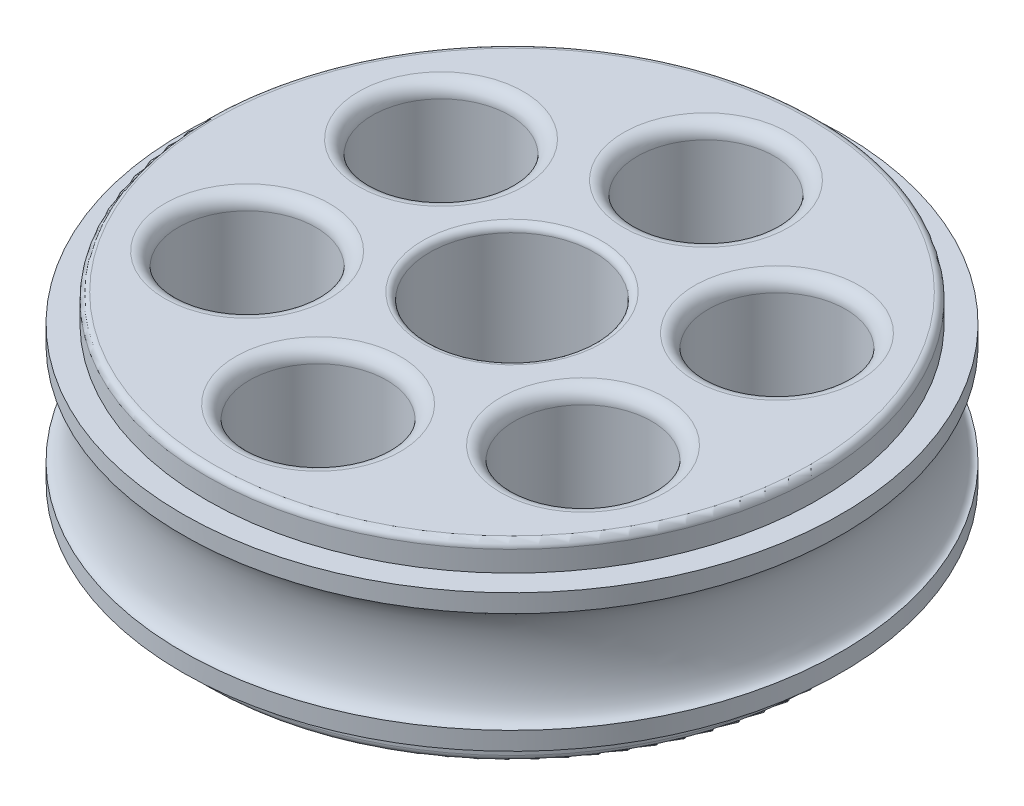
ISO-10303-21;
HEADER;
FILE_DESCRIPTION(('STEP AP214'),'2;1');
FILE_NAME('part.step','',(''),(''),'','','');
FILE_SCHEMA(('AUTOMOTIVE_DESIGN { 1 0 10303 214 1 1 1 1 }'));
ENDSEC;
DATA;
#1=APPLICATION_CONTEXT('core data for automotive mechanical design processes');
#2=APPLICATION_PROTOCOL_DEFINITION('international standard','automotive_design',2000,#1);
#3=PRODUCT_CONTEXT('',#1,'mechanical');
#4=PRODUCT('Part','Part','',(#3));
#5=PRODUCT_RELATED_PRODUCT_CATEGORY('part','',(#4));
#6=PRODUCT_DEFINITION_FORMATION('','',#4);
#7=PRODUCT_DEFINITION_CONTEXT('part definition',#1,'design');
#8=PRODUCT_DEFINITION('design','',#6,#7);
#9=PRODUCT_DEFINITION_SHAPE('','',#8);
#10=(LENGTH_UNIT() NAMED_UNIT(*) SI_UNIT(.MILLI.,.METRE.));
#11=(NAMED_UNIT(*) PLANE_ANGLE_UNIT() SI_UNIT($,.RADIAN.));
#12=(NAMED_UNIT(*) SI_UNIT($,.STERADIAN.) SOLID_ANGLE_UNIT());
#13=UNCERTAINTY_MEASURE_WITH_UNIT(LENGTH_MEASURE(1.E-05),#10,'distance_accuracy_value','');
#14=(GEOMETRIC_REPRESENTATION_CONTEXT(3) GLOBAL_UNCERTAINTY_ASSIGNED_CONTEXT((#13)) GLOBAL_UNIT_ASSIGNED_CONTEXT((#10,
#11,#12)) REPRESENTATION_CONTEXT('',''));
#15=CARTESIAN_POINT('',(0.,0.,0.));
#16=DIRECTION('',(0.,0.,1.));
#17=DIRECTION('',(1.,0.,0.));
#18=AXIS2_PLACEMENT_3D('',#15,#16,#17);
#19=CARTESIAN_POINT('',(0.,15.24,0.));
#20=DIRECTION('',(0.,-1.,0.));
#21=DIRECTION('',(0.,0.,-1.));
#22=AXIS2_PLACEMENT_3D('',#19,#20,#21);
#23=CYLINDRICAL_SURFACE('',#22,30.48);
#24=CARTESIAN_POINT('',(0.,15.24,0.));
#25=DIRECTION('',(0.,1.,0.));
#26=DIRECTION('',(0.,0.,1.));
#27=AXIS2_PLACEMENT_3D('',#24,#25,#26);
#28=CIRCLE('',#27,30.48);
#29=CARTESIAN_POINT('',(0.,15.24,30.48));
#30=VERTEX_POINT('',#29);
#31=EDGE_CURVE('E56',#30,#30,#28,.T.);
#32=ORIENTED_EDGE('',*,*,#31,.F.);
#33=EDGE_LOOP('',(#32));
#34=FACE_BOUND('',#33,.T.);
#35=CARTESIAN_POINT('',(0.,13.5621595032944,0.));
#36=DIRECTION('',(0.,-1.,0.));
#37=DIRECTION('',(0.,0.,-1.));
#38=AXIS2_PLACEMENT_3D('',#35,#36,#37);
#39=CIRCLE('',#38,30.48);
#40=CARTESIAN_POINT('',(0.,13.5621595032944,-30.48));
#41=VERTEX_POINT('',#40);
#42=EDGE_CURVE('E35',#41,#41,#39,.T.);
#43=ORIENTED_EDGE('',*,*,#42,.F.);
#44=EDGE_LOOP('',(#43));
#45=FACE_BOUND('',#44,.T.);
#46=ADVANCED_FACE('F31',(#34,#45),#23,.T.);
#47=CARTESIAN_POINT('',(0.,2.54,0.));
#48=DIRECTION('',(0.,1.,0.));
#49=DIRECTION('',(0.,0.,1.));
#50=AXIS2_PLACEMENT_3D('',#47,#48,#49);
#51=CIRCLE('',#50,30.48);
#52=CARTESIAN_POINT('',(0.,2.54,30.48));
#53=VERTEX_POINT('',#52);
#54=EDGE_CURVE('E52',#53,#53,#51,.T.);
#55=ORIENTED_EDGE('',*,*,#54,.T.);
#56=EDGE_LOOP('',(#55));
#57=FACE_BOUND('',#56,.T.);
#58=CARTESIAN_POINT('',(0.,4.21784049670554,0.));
#59=DIRECTION('',(0.,-1.,0.));
#60=DIRECTION('',(0.,0.,-1.));
#61=AXIS2_PLACEMENT_3D('',#58,#59,#60);
#62=CIRCLE('',#61,30.48);
#63=CARTESIAN_POINT('',(0.,4.21784049670551,-30.48));
#64=VERTEX_POINT('',#63);
#65=EDGE_CURVE('E47',#64,#64,#62,.F.);
#66=ORIENTED_EDGE('',*,*,#65,.F.);
#67=EDGE_LOOP('',(#66));
#68=FACE_BOUND('',#67,.T.);
#69=ADVANCED_FACE('F178',(#57,#68),#23,.T.);
#70=CARTESIAN_POINT('',(0.,2.54,0.));
#71=DIRECTION('',(0.,-1.,0.));
#72=DIRECTION('',(0.,0.,-1.));
#73=AXIS2_PLACEMENT_3D('',#70,#71,#72);
#74=CYLINDRICAL_SURFACE('',#73,28.2575);
#75=CARTESIAN_POINT('',(0.,0.635,0.));
#76=DIRECTION('',(0.,1.,0.));
#77=DIRECTION('',(0.,0.,1.));
#78=AXIS2_PLACEMENT_3D('',#75,#76,#77);
#79=CIRCLE('',#78,28.2575);
#80=CARTESIAN_POINT('',(0.,0.635,28.2575));
#81=VERTEX_POINT('',#80);
#82=EDGE_CURVE('E89',#81,#81,#79,.T.);
#83=ORIENTED_EDGE('',*,*,#82,.T.);
#84=EDGE_LOOP('',(#83));
#85=FACE_BOUND('',#84,.T.);
#86=CARTESIAN_POINT('',(0.,2.54,0.));
#87=DIRECTION('',(0.,1.,0.));
#88=DIRECTION('',(0.,0.,1.));
#89=AXIS2_PLACEMENT_3D('',#86,#87,#88);
#90=CIRCLE('',#89,28.2575);
#91=CARTESIAN_POINT('',(0.,2.54,28.2575));
#92=VERTEX_POINT('',#91);
#93=EDGE_CURVE('E61',#92,#92,#90,.T.);
#94=ORIENTED_EDGE('',*,*,#93,.F.);
#95=EDGE_LOOP('',(#94));
#96=FACE_BOUND('',#95,.T.);
#97=ADVANCED_FACE('F184',(#85,#96),#74,.T.);
#98=CARTESIAN_POINT('',(0.,0.,0.));
#99=DIRECTION('',(0.,1.,0.));
#100=DIRECTION('',(0.,0.,1.));
#101=AXIS2_PLACEMENT_3D('',#98,#99,#100);
#102=PLANE('',#101);
#103=CARTESIAN_POINT('',(0.,0.,17.93875));
#104=DIRECTION('',(0.,1.,0.));
#105=DIRECTION('',(0.,0.,1.));
#106=AXIS2_PLACEMENT_3D('',#103,#104,#105);
#107=CIRCLE('',#106,7.62);
#108=CARTESIAN_POINT('',(0.,0.,25.55875));
#109=VERTEX_POINT('',#108);
#110=EDGE_CURVE('E113',#109,#109,#107,.T.);
#111=ORIENTED_EDGE('',*,*,#110,.T.);
#112=EDGE_LOOP('',(#111));
#113=FACE_BOUND('',#112,.T.);
#114=CARTESIAN_POINT('',(-15.5354132121376,0.,8.96937499999911));
#115=DIRECTION('',(0.,1.,0.));
#116=DIRECTION('',(0.,0.,1.));
#117=AXIS2_PLACEMENT_3D('',#114,#115,#116);
#118=CIRCLE('',#117,7.62000000000096);
#119=CARTESIAN_POINT('',(-15.5354132121376,0.,16.5893750000001));
#120=VERTEX_POINT('',#119);
#121=EDGE_CURVE('E110',#120,#120,#118,.T.);
#122=ORIENTED_EDGE('',*,*,#121,.T.);
#123=EDGE_LOOP('',(#122));
#124=FACE_BOUND('',#123,.T.);
#125=CARTESIAN_POINT('',(-15.5354132121366,0.,-8.96937500000089));
#126=DIRECTION('',(0.,1.,0.));
#127=DIRECTION('',(0.,0.,1.));
#128=AXIS2_PLACEMENT_3D('',#125,#126,#127);
#129=CIRCLE('',#128,7.62000000000188);
#130=CARTESIAN_POINT('',(-15.5354132121366,0.,-1.34937499999901));
#131=VERTEX_POINT('',#130);
#132=EDGE_CURVE('E107',#131,#131,#129,.T.);
#133=ORIENTED_EDGE('',*,*,#132,.T.);
#134=EDGE_LOOP('',(#133));
#135=FACE_BOUND('',#134,.T.);
#136=CARTESIAN_POINT('',(2.035006033625E-12,0.,-17.93875));
#137=DIRECTION('',(0.,1.,0.));
#138=DIRECTION('',(0.,0.,1.));
#139=AXIS2_PLACEMENT_3D('',#136,#137,#138);
#140=CIRCLE('',#139,7.62000000000207);
#141=CARTESIAN_POINT('',(2.035006033625E-12,0.,-10.3187499999979));
#142=VERTEX_POINT('',#141);
#143=EDGE_CURVE('E104',#142,#142,#140,.T.);
#144=ORIENTED_EDGE('',*,*,#143,.T.);
#145=EDGE_LOOP('',(#144));
#146=FACE_BOUND('',#145,.T.);
#147=CARTESIAN_POINT('',(15.5354132121396,0.,-8.96937499999911));
#148=DIRECTION('',(0.,1.,0.));
#149=DIRECTION('',(0.,0.,1.));
#150=AXIS2_PLACEMENT_3D('',#147,#148,#149);
#151=CIRCLE('',#150,7.62000000000128);
#152=CARTESIAN_POINT('',(15.5354132121396,0.,-1.34937499999783));
#153=VERTEX_POINT('',#152);
#154=EDGE_CURVE('E101',#153,#153,#151,.T.);
#155=ORIENTED_EDGE('',*,*,#154,.T.);
#156=EDGE_LOOP('',(#155));
#157=FACE_BOUND('',#156,.T.);
#158=CARTESIAN_POINT('',(15.5354132121386,0.,8.96937500000088));
#159=DIRECTION('',(0.,1.,0.));
#160=DIRECTION('',(0.,0.,1.));
#161=AXIS2_PLACEMENT_3D('',#158,#159,#160);
#162=CIRCLE('',#161,7.62000000000027);
#163=CARTESIAN_POINT('',(15.5354132121386,0.,16.5893750000012));
#164=VERTEX_POINT('',#163);
#165=EDGE_CURVE('E98',#164,#164,#162,.T.);
#166=ORIENTED_EDGE('',*,*,#165,.T.);
#167=EDGE_LOOP('',(#166));
#168=FACE_BOUND('',#167,.T.);
#169=CARTESIAN_POINT('',(0.,0.,0.));
#170=DIRECTION('',(0.,1.,0.));
#171=DIRECTION('',(0.,0.,1.));
#172=AXIS2_PLACEMENT_3D('',#169,#170,#171);
#173=CIRCLE('',#172,8.255);
#174=CARTESIAN_POINT('',(0.,0.,8.255));
#175=VERTEX_POINT('',#174);
#176=EDGE_CURVE('E71',#175,#175,#173,.T.);
#177=ORIENTED_EDGE('',*,*,#176,.T.);
#178=EDGE_LOOP('',(#177));
#179=FACE_BOUND('',#178,.T.);
#180=CARTESIAN_POINT('',(0.,0.,0.));
#181=DIRECTION('',(0.,1.,0.));
#182=DIRECTION('',(0.,0.,1.));
#183=AXIS2_PLACEMENT_3D('',#180,#181,#182);
#184=CIRCLE('',#183,27.6225);
#185=CARTESIAN_POINT('',(0.,0.,27.6225));
#186=VERTEX_POINT('',#185);
#187=EDGE_CURVE('E68',#186,#186,#184,.F.);
#188=ORIENTED_EDGE('',*,*,#187,.T.);
#189=EDGE_LOOP('',(#188));
#190=FACE_BOUND('',#189,.T.);
#191=ADVANCED_FACE('F191',(#113,#124,#135,#146,#157,#168,#179,#190),#102,.F.);
#192=CARTESIAN_POINT('',(0.,15.24,0.));
#193=DIRECTION('',(0.,1.,0.));
#194=DIRECTION('',(0.,0.,1.));
#195=AXIS2_PLACEMENT_3D('',#192,#193,#194);
#196=PLANE('',#195);
#197=CARTESIAN_POINT('',(0.,15.24,0.));
#198=DIRECTION('',(0.,1.,0.));
#199=DIRECTION('',(0.,0.,1.));
#200=AXIS2_PLACEMENT_3D('',#197,#198,#199);
#201=CIRCLE('',#200,28.2575);
#202=CARTESIAN_POINT('',(0.,15.24,28.2575));
#203=VERTEX_POINT('',#202);
#204=EDGE_CURVE('E67',#203,#203,#201,.T.);
#205=ORIENTED_EDGE('',*,*,#204,.F.);
#206=EDGE_LOOP('',(#205));
#207=FACE_BOUND('',#206,.T.);
#208=ORIENTED_EDGE('',*,*,#31,.T.);
#209=EDGE_LOOP('',(#208));
#210=FACE_BOUND('',#209,.T.);
#211=ADVANCED_FACE('F194',(#207,#210),#196,.T.);
#212=CARTESIAN_POINT('',(0.,2.54,0.));
#213=DIRECTION('',(0.,1.,0.));
#214=DIRECTION('',(0.,0.,1.));
#215=AXIS2_PLACEMENT_3D('',#212,#213,#214);
#216=PLANE('',#215);
#217=ORIENTED_EDGE('',*,*,#93,.T.);
#218=EDGE_LOOP('',(#217));
#219=FACE_BOUND('',#218,.T.);
#220=ORIENTED_EDGE('',*,*,#54,.F.);
#221=EDGE_LOOP('',(#220));
#222=FACE_BOUND('',#221,.T.);
#223=ADVANCED_FACE('F189',(#219,#222),#216,.F.);
#224=CARTESIAN_POINT('',(0.,17.78,0.));
#225=DIRECTION('',(0.,-1.,0.));
#226=DIRECTION('',(0.,0.,-1.));
#227=AXIS2_PLACEMENT_3D('',#224,#225,#226);
#228=CYLINDRICAL_SURFACE('',#227,28.2575);
#229=CARTESIAN_POINT('',(0.,17.145,0.));
#230=DIRECTION('',(0.,1.,0.));
#231=DIRECTION('',(0.,0.,1.));
#232=AXIS2_PLACEMENT_3D('',#229,#230,#231);
#233=CIRCLE('',#232,28.2575);
#234=CARTESIAN_POINT('',(0.,17.145,28.2575));
#235=VERTEX_POINT('',#234);
#236=EDGE_CURVE('E86',#235,#235,#233,.F.);
#237=ORIENTED_EDGE('',*,*,#236,.T.);
#238=EDGE_LOOP('',(#237));
#239=FACE_BOUND('',#238,.T.);
#240=ORIENTED_EDGE('',*,*,#204,.T.);
#241=EDGE_LOOP('',(#240));
#242=FACE_BOUND('',#241,.T.);
#243=ADVANCED_FACE('F262',(#239,#242),#228,.T.);
#244=CARTESIAN_POINT('',(0.,17.78,0.));
#245=DIRECTION('',(0.,1.,0.));
#246=DIRECTION('',(0.,0.,1.));
#247=AXIS2_PLACEMENT_3D('',#244,#245,#246);
#248=PLANE('',#247);
#249=CARTESIAN_POINT('',(0.,17.78,17.93875));
#250=DIRECTION('',(0.,1.,0.));
#251=DIRECTION('',(0.,0.,1.));
#252=AXIS2_PLACEMENT_3D('',#249,#250,#251);
#253=CIRCLE('',#252,7.62);
#254=CARTESIAN_POINT('',(0.,17.78,25.55875));
#255=VERTEX_POINT('',#254);
#256=EDGE_CURVE('E131',#255,#255,#253,.F.);
#257=ORIENTED_EDGE('',*,*,#256,.T.);
#258=EDGE_LOOP('',(#257));
#259=FACE_BOUND('',#258,.T.);
#260=CARTESIAN_POINT('',(-15.5354132121376,17.78,8.96937499999911));
#261=DIRECTION('',(0.,1.,0.));
#262=DIRECTION('',(0.,0.,1.));
#263=AXIS2_PLACEMENT_3D('',#260,#261,#262);
#264=CIRCLE('',#263,7.62000000000096);
#265=CARTESIAN_POINT('',(-15.5354132121376,17.78,16.5893750000001));
#266=VERTEX_POINT('',#265);
#267=EDGE_CURVE('E128',#266,#266,#264,.F.);
#268=ORIENTED_EDGE('',*,*,#267,.T.);
#269=EDGE_LOOP('',(#268));
#270=FACE_BOUND('',#269,.T.);
#271=CARTESIAN_POINT('',(-15.5354132121366,17.78,-8.96937500000089));
#272=DIRECTION('',(0.,1.,0.));
#273=DIRECTION('',(0.,0.,1.));
#274=AXIS2_PLACEMENT_3D('',#271,#272,#273);
#275=CIRCLE('',#274,7.62000000000188);
#276=CARTESIAN_POINT('',(-15.5354132121366,17.78,-1.34937499999901));
#277=VERTEX_POINT('',#276);
#278=EDGE_CURVE('E125',#277,#277,#275,.F.);
#279=ORIENTED_EDGE('',*,*,#278,.T.);
#280=EDGE_LOOP('',(#279));
#281=FACE_BOUND('',#280,.T.);
#282=CARTESIAN_POINT('',(2.035006033625E-12,17.78,-17.93875));
#283=DIRECTION('',(0.,1.,0.));
#284=DIRECTION('',(0.,0.,1.));
#285=AXIS2_PLACEMENT_3D('',#282,#283,#284);
#286=CIRCLE('',#285,7.62000000000207);
#287=CARTESIAN_POINT('',(2.035006033625E-12,17.78,-10.3187499999979));
#288=VERTEX_POINT('',#287);
#289=EDGE_CURVE('E122',#288,#288,#286,.F.);
#290=ORIENTED_EDGE('',*,*,#289,.T.);
#291=EDGE_LOOP('',(#290));
#292=FACE_BOUND('',#291,.T.);
#293=CARTESIAN_POINT('',(15.5354132121396,17.78,-8.96937499999911));
#294=DIRECTION('',(0.,1.,0.));
#295=DIRECTION('',(0.,0.,1.));
#296=AXIS2_PLACEMENT_3D('',#293,#294,#295);
#297=CIRCLE('',#296,7.62000000000128);
#298=CARTESIAN_POINT('',(15.5354132121396,17.78,-1.34937499999783));
#299=VERTEX_POINT('',#298);
#300=EDGE_CURVE('E119',#299,#299,#297,.F.);
#301=ORIENTED_EDGE('',*,*,#300,.T.);
#302=EDGE_LOOP('',(#301));
#303=FACE_BOUND('',#302,.T.);
#304=CARTESIAN_POINT('',(15.5354132121386,17.78,8.96937500000088));
#305=DIRECTION('',(0.,1.,0.));
#306=DIRECTION('',(0.,0.,1.));
#307=AXIS2_PLACEMENT_3D('',#304,#305,#306);
#308=CIRCLE('',#307,7.62000000000027);
#309=CARTESIAN_POINT('',(15.5354132121386,17.78,16.5893750000012));
#310=VERTEX_POINT('',#309);
#311=EDGE_CURVE('E116',#310,#310,#308,.F.);
#312=ORIENTED_EDGE('',*,*,#311,.T.);
#313=EDGE_LOOP('',(#312));
#314=FACE_BOUND('',#313,.T.);
#315=CARTESIAN_POINT('',(0.,17.78,0.));
#316=DIRECTION('',(0.,1.,0.));
#317=DIRECTION('',(0.,0.,1.));
#318=AXIS2_PLACEMENT_3D('',#315,#316,#317);
#319=CIRCLE('',#318,8.255);
#320=CARTESIAN_POINT('',(0.,17.78,8.255));
#321=VERTEX_POINT('',#320);
#322=EDGE_CURVE('E83',#321,#321,#319,.F.);
#323=ORIENTED_EDGE('',*,*,#322,.T.);
#324=EDGE_LOOP('',(#323));
#325=FACE_BOUND('',#324,.T.);
#326=CARTESIAN_POINT('',(0.,17.78,0.));
#327=DIRECTION('',(0.,1.,0.));
#328=DIRECTION('',(0.,0.,1.));
#329=AXIS2_PLACEMENT_3D('',#326,#327,#328);
#330=CIRCLE('',#329,27.6225);
#331=CARTESIAN_POINT('',(0.,17.78,27.6225));
#332=VERTEX_POINT('',#331);
#333=EDGE_CURVE('E80',#332,#332,#330,.T.);
#334=ORIENTED_EDGE('',*,*,#333,.T.);
#335=EDGE_LOOP('',(#334));
#336=FACE_BOUND('',#335,.T.);
#337=ADVANCED_FACE('F259',(#259,#270,#281,#292,#303,#314,#325,#336),#248,.T.);
#338=CARTESIAN_POINT('',(0.,0.,0.));
#339=DIRECTION('',(0.,1.,0.));
#340=DIRECTION('',(0.,0.,1.));
#341=AXIS2_PLACEMENT_3D('',#338,#339,#340);
#342=CYLINDRICAL_SURFACE('',#341,7.62);
#343=CARTESIAN_POINT('',(0.,0.635,0.));
#344=DIRECTION('',(0.,1.,0.));
#345=DIRECTION('',(0.,0.,1.));
#346=AXIS2_PLACEMENT_3D('',#343,#344,#345);
#347=CIRCLE('',#346,7.62);
#348=CARTESIAN_POINT('',(0.,0.635,7.62));
#349=VERTEX_POINT('',#348);
#350=EDGE_CURVE('E77',#349,#349,#347,.F.);
#351=ORIENTED_EDGE('',*,*,#350,.T.);
#352=EDGE_LOOP('',(#351));
#353=FACE_BOUND('',#352,.T.);
#354=CARTESIAN_POINT('',(0.,17.145,0.));
#355=DIRECTION('',(0.,1.,0.));
#356=DIRECTION('',(0.,0.,1.));
#357=AXIS2_PLACEMENT_3D('',#354,#355,#356);
#358=CIRCLE('',#357,7.62);
#359=CARTESIAN_POINT('',(0.,17.145,7.62));
#360=VERTEX_POINT('',#359);
#361=EDGE_CURVE('E74',#360,#360,#358,.T.);
#362=ORIENTED_EDGE('',*,*,#361,.T.);
#363=EDGE_LOOP('',(#362));
#364=FACE_BOUND('',#363,.T.);
#365=ADVANCED_FACE('F203',(#353,#364),#342,.F.);
#366=CARTESIAN_POINT('',(0.,0.635,0.));
#367=DIRECTION('',(0.,1.,0.));
#368=DIRECTION('',(0.,0.,1.));
#369=AXIS2_PLACEMENT_3D('',#366,#367,#368);
#370=TOROIDAL_SURFACE('',#369,8.255,0.635);
#371=ORIENTED_EDGE('',*,*,#350,.F.);
#372=EDGE_LOOP('',(#371));
#373=FACE_BOUND('',#372,.T.);
#374=ORIENTED_EDGE('',*,*,#176,.F.);
#375=EDGE_LOOP('',(#374));
#376=FACE_BOUND('',#375,.T.);
#377=ADVANCED_FACE('F199',(#373,#376),#370,.T.);
#378=CARTESIAN_POINT('',(0.,17.145,0.));
#379=DIRECTION('',(0.,1.,0.));
#380=DIRECTION('',(0.,0.,1.));
#381=AXIS2_PLACEMENT_3D('',#378,#379,#380);
#382=TOROIDAL_SURFACE('',#381,8.255,0.635);
#383=ORIENTED_EDGE('',*,*,#322,.F.);
#384=EDGE_LOOP('',(#383));
#385=FACE_BOUND('',#384,.T.);
#386=ORIENTED_EDGE('',*,*,#361,.F.);
#387=EDGE_LOOP('',(#386));
#388=FACE_BOUND('',#387,.T.);
#389=ADVANCED_FACE('F202',(#385,#388),#382,.T.);
#390=CARTESIAN_POINT('',(0.,17.145,0.));
#391=DIRECTION('',(0.,1.,0.));
#392=DIRECTION('',(0.,0.,1.));
#393=AXIS2_PLACEMENT_3D('',#390,#391,#392);
#394=TOROIDAL_SURFACE('',#393,27.6225,0.635);
#395=ORIENTED_EDGE('',*,*,#236,.F.);
#396=EDGE_LOOP('',(#395));
#397=FACE_BOUND('',#396,.T.);
#398=ORIENTED_EDGE('',*,*,#333,.F.);
#399=EDGE_LOOP('',(#398));
#400=FACE_BOUND('',#399,.T.);
#401=ADVANCED_FACE('F207',(#397,#400),#394,.T.);
#402=CARTESIAN_POINT('',(0.,0.635,0.));
#403=DIRECTION('',(0.,1.,0.));
#404=DIRECTION('',(0.,0.,1.));
#405=AXIS2_PLACEMENT_3D('',#402,#403,#404);
#406=TOROIDAL_SURFACE('',#405,27.6225,0.635);
#407=ORIENTED_EDGE('',*,*,#187,.F.);
#408=EDGE_LOOP('',(#407));
#409=FACE_BOUND('',#408,.T.);
#410=ORIENTED_EDGE('',*,*,#82,.F.);
#411=EDGE_LOOP('',(#410));
#412=FACE_BOUND('',#411,.T.);
#413=ADVANCED_FACE('F211',(#409,#412),#406,.T.);
#414=CARTESIAN_POINT('',(0.,17.78,17.93875));
#415=DIRECTION('',(0.,-1.,0.));
#416=DIRECTION('',(0.,0.,-1.));
#417=AXIS2_PLACEMENT_3D('',#414,#415,#416);
#418=CYLINDRICAL_SURFACE('',#417,6.35);
#419=CARTESIAN_POINT('',(0.,1.27,17.93875));
#420=DIRECTION('',(0.,1.,0.));
#421=DIRECTION('',(0.,0.,1.));
#422=AXIS2_PLACEMENT_3D('',#419,#420,#421);
#423=CIRCLE('',#422,6.35);
#424=CARTESIAN_POINT('',(0.,1.27,24.28875));
#425=VERTEX_POINT('',#424);
#426=EDGE_CURVE('E95',#425,#425,#423,.F.);
#427=ORIENTED_EDGE('',*,*,#426,.T.);
#428=EDGE_LOOP('',(#427));
#429=FACE_BOUND('',#428,.T.);
#430=CARTESIAN_POINT('',(0.,16.51,17.93875));
#431=DIRECTION('',(0.,1.,0.));
#432=DIRECTION('',(0.,0.,1.));
#433=AXIS2_PLACEMENT_3D('',#430,#431,#432);
#434=CIRCLE('',#433,6.35);
#435=CARTESIAN_POINT('',(0.,16.51,24.28875));
#436=VERTEX_POINT('',#435);
#437=EDGE_CURVE('E92',#436,#436,#434,.T.);
#438=ORIENTED_EDGE('',*,*,#437,.T.);
#439=EDGE_LOOP('',(#438));
#440=FACE_BOUND('',#439,.T.);
#441=ADVANCED_FACE('F215',(#429,#440),#418,.F.);
#442=CARTESIAN_POINT('',(-15.5354132121376,17.78,8.96937499999911));
#443=DIRECTION('',(0.,-1.,0.));
#444=DIRECTION('',(0.,0.,-1.));
#445=AXIS2_PLACEMENT_3D('',#442,#443,#444);
#446=CYLINDRICAL_SURFACE('',#445,6.35000000000096);
#447=CARTESIAN_POINT('',(-15.5354132121376,1.27,8.96937499999911));
#448=DIRECTION('',(0.,1.,0.));
#449=DIRECTION('',(0.,0.,1.));
#450=AXIS2_PLACEMENT_3D('',#447,#448,#449);
#451=CIRCLE('',#450,6.35000000000096);
#452=CARTESIAN_POINT('',(-15.5354132121376,1.27,15.3193750000001));
#453=VERTEX_POINT('',#452);
#454=EDGE_CURVE('E137',#453,#453,#451,.F.);
#455=ORIENTED_EDGE('',*,*,#454,.T.);
#456=EDGE_LOOP('',(#455));
#457=FACE_BOUND('',#456,.T.);
#458=CARTESIAN_POINT('',(-15.5354132121376,16.51,8.96937499999911));
#459=DIRECTION('',(0.,1.,0.));
#460=DIRECTION('',(0.,0.,1.));
#461=AXIS2_PLACEMENT_3D('',#458,#459,#460);
#462=CIRCLE('',#461,6.35000000000096);
#463=CARTESIAN_POINT('',(-15.5354132121376,16.51,15.3193750000001));
#464=VERTEX_POINT('',#463);
#465=EDGE_CURVE('E134',#464,#464,#462,.T.);
#466=ORIENTED_EDGE('',*,*,#465,.T.);
#467=EDGE_LOOP('',(#466));
#468=FACE_BOUND('',#467,.T.);
#469=ADVANCED_FACE('F302',(#457,#468),#446,.F.);
#470=CARTESIAN_POINT('',(-15.5354132121366,17.78,-8.96937500000089));
#471=DIRECTION('',(0.,-1.,0.));
#472=DIRECTION('',(0.,0.,-1.));
#473=AXIS2_PLACEMENT_3D('',#470,#471,#472);
#474=CYLINDRICAL_SURFACE('',#473,6.35000000000188);
#475=CARTESIAN_POINT('',(-15.5354132121366,1.27,-8.96937500000089));
#476=DIRECTION('',(0.,1.,0.));
#477=DIRECTION('',(0.,0.,1.));
#478=AXIS2_PLACEMENT_3D('',#475,#476,#477);
#479=CIRCLE('',#478,6.35000000000188);
#480=CARTESIAN_POINT('',(-15.5354132121366,1.27,-2.61937499999901));
#481=VERTEX_POINT('',#480);
#482=EDGE_CURVE('E143',#481,#481,#479,.F.);
#483=ORIENTED_EDGE('',*,*,#482,.T.);
#484=EDGE_LOOP('',(#483));
#485=FACE_BOUND('',#484,.T.);
#486=CARTESIAN_POINT('',(-15.5354132121366,16.51,-8.96937500000089));
#487=DIRECTION('',(0.,1.,0.));
#488=DIRECTION('',(0.,0.,1.));
#489=AXIS2_PLACEMENT_3D('',#486,#487,#488);
#490=CIRCLE('',#489,6.35000000000188);
#491=CARTESIAN_POINT('',(-15.5354132121366,16.51,-2.61937499999901));
#492=VERTEX_POINT('',#491);
#493=EDGE_CURVE('E140',#492,#492,#490,.T.);
#494=ORIENTED_EDGE('',*,*,#493,.T.);
#495=EDGE_LOOP('',(#494));
#496=FACE_BOUND('',#495,.T.);
#497=ADVANCED_FACE('F253',(#485,#496),#474,.F.);
#498=CARTESIAN_POINT('',(2.035006033625E-12,17.78,-17.93875));
#499=DIRECTION('',(0.,-1.,0.));
#500=DIRECTION('',(0.,0.,-1.));
#501=AXIS2_PLACEMENT_3D('',#498,#499,#500);
#502=CYLINDRICAL_SURFACE('',#501,6.35000000000207);
#503=CARTESIAN_POINT('',(2.035006033625E-12,1.27,-17.93875));
#504=DIRECTION('',(0.,1.,0.));
#505=DIRECTION('',(0.,0.,1.));
#506=AXIS2_PLACEMENT_3D('',#503,#504,#505);
#507=CIRCLE('',#506,6.35000000000207);
#508=CARTESIAN_POINT('',(2.035006033625E-12,1.27,-11.5887499999979));
#509=VERTEX_POINT('',#508);
#510=EDGE_CURVE('E149',#509,#509,#507,.F.);
#511=ORIENTED_EDGE('',*,*,#510,.T.);
#512=EDGE_LOOP('',(#511));
#513=FACE_BOUND('',#512,.T.);
#514=CARTESIAN_POINT('',(2.035006033625E-12,16.51,-17.93875));
#515=DIRECTION('',(0.,1.,0.));
#516=DIRECTION('',(0.,0.,1.));
#517=AXIS2_PLACEMENT_3D('',#514,#515,#516);
#518=CIRCLE('',#517,6.35000000000207);
#519=CARTESIAN_POINT('',(2.035006033625E-12,16.51,-11.5887499999979));
#520=VERTEX_POINT('',#519);
#521=EDGE_CURVE('E146',#520,#520,#518,.T.);
#522=ORIENTED_EDGE('',*,*,#521,.T.);
#523=EDGE_LOOP('',(#522));
#524=FACE_BOUND('',#523,.T.);
#525=ADVANCED_FACE('F250',(#513,#524),#502,.F.);
#526=CARTESIAN_POINT('',(15.5354132121396,17.78,-8.96937499999911));
#527=DIRECTION('',(0.,-1.,0.));
#528=DIRECTION('',(0.,0.,-1.));
#529=AXIS2_PLACEMENT_3D('',#526,#527,#528);
#530=CYLINDRICAL_SURFACE('',#529,6.35000000000128);
#531=CARTESIAN_POINT('',(15.5354132121396,1.27,-8.96937499999911));
#532=DIRECTION('',(0.,1.,0.));
#533=DIRECTION('',(0.,0.,1.));
#534=AXIS2_PLACEMENT_3D('',#531,#532,#533);
#535=CIRCLE('',#534,6.35000000000128);
#536=CARTESIAN_POINT('',(15.5354132121396,1.27,-2.61937499999783));
#537=VERTEX_POINT('',#536);
#538=EDGE_CURVE('E44',#537,#537,#535,.F.);
#539=ORIENTED_EDGE('',*,*,#538,.T.);
#540=EDGE_LOOP('',(#539));
#541=FACE_BOUND('',#540,.T.);
#542=CARTESIAN_POINT('',(15.5354132121396,16.51,-8.96937499999911));
#543=DIRECTION('',(0.,1.,0.));
#544=DIRECTION('',(0.,0.,1.));
#545=AXIS2_PLACEMENT_3D('',#542,#543,#544);
#546=CIRCLE('',#545,6.35000000000128);
#547=CARTESIAN_POINT('',(15.5354132121396,16.51,-2.61937499999783));
#548=VERTEX_POINT('',#547);
#549=EDGE_CURVE('E152',#548,#548,#546,.T.);
#550=ORIENTED_EDGE('',*,*,#549,.T.);
#551=EDGE_LOOP('',(#550));
#552=FACE_BOUND('',#551,.T.);
#553=ADVANCED_FACE('F157',(#541,#552),#530,.F.);
#554=CARTESIAN_POINT('',(15.5354132121386,17.78,8.96937500000088));
#555=DIRECTION('',(0.,-1.,0.));
#556=DIRECTION('',(0.,0.,-1.));
#557=AXIS2_PLACEMENT_3D('',#554,#555,#556);
#558=CYLINDRICAL_SURFACE('',#557,6.35000000000027);
#559=CARTESIAN_POINT('',(15.5354132121386,1.27,8.96937500000088));
#560=DIRECTION('',(0.,1.,0.));
#561=DIRECTION('',(0.,0.,1.));
#562=AXIS2_PLACEMENT_3D('',#559,#560,#561);
#563=CIRCLE('',#562,6.35000000000027);
#564=CARTESIAN_POINT('',(15.5354132121386,1.27,15.3193750000012));
#565=VERTEX_POINT('',#564);
#566=EDGE_CURVE('E10',#565,#565,#563,.F.);
#567=ORIENTED_EDGE('',*,*,#566,.T.);
#568=EDGE_LOOP('',(#567));
#569=FACE_BOUND('',#568,.T.);
#570=CARTESIAN_POINT('',(15.5354132121386,16.51,8.96937500000088));
#571=DIRECTION('',(0.,1.,0.));
#572=DIRECTION('',(0.,0.,1.));
#573=AXIS2_PLACEMENT_3D('',#570,#571,#572);
#574=CIRCLE('',#573,6.35000000000027);
#575=CARTESIAN_POINT('',(15.5354132121386,16.51,15.3193750000012));
#576=VERTEX_POINT('',#575);
#577=EDGE_CURVE('E39',#576,#576,#574,.T.);
#578=ORIENTED_EDGE('',*,*,#577,.T.);
#579=EDGE_LOOP('',(#578));
#580=FACE_BOUND('',#579,.T.);
#581=ADVANCED_FACE('F221',(#569,#580),#558,.F.);
#582=CARTESIAN_POINT('',(0.,1.27,17.93875));
#583=DIRECTION('',(0.,1.,0.));
#584=DIRECTION('',(0.,0.,1.));
#585=AXIS2_PLACEMENT_3D('',#582,#583,#584);
#586=TOROIDAL_SURFACE('',#585,7.62,1.27);
#587=ORIENTED_EDGE('',*,*,#110,.F.);
#588=EDGE_LOOP('',(#587));
#589=FACE_BOUND('',#588,.T.);
#590=ORIENTED_EDGE('',*,*,#426,.F.);
#591=EDGE_LOOP('',(#590));
#592=FACE_BOUND('',#591,.T.);
#593=ADVANCED_FACE('F217',(#589,#592),#586,.T.);
#594=CARTESIAN_POINT('',(0.,16.51,17.93875));
#595=DIRECTION('',(0.,1.,0.));
#596=DIRECTION('',(0.,0.,1.));
#597=AXIS2_PLACEMENT_3D('',#594,#595,#596);
#598=TOROIDAL_SURFACE('',#597,7.62,1.27);
#599=ORIENTED_EDGE('',*,*,#437,.F.);
#600=EDGE_LOOP('',(#599));
#601=FACE_BOUND('',#600,.T.);
#602=ORIENTED_EDGE('',*,*,#256,.F.);
#603=EDGE_LOOP('',(#602));
#604=FACE_BOUND('',#603,.T.);
#605=ADVANCED_FACE('F220',(#601,#604),#598,.T.);
#606=CARTESIAN_POINT('',(-15.5354132121376,1.27,8.96937499999911));
#607=DIRECTION('',(0.,1.,0.));
#608=DIRECTION('',(0.,0.,1.));
#609=AXIS2_PLACEMENT_3D('',#606,#607,#608);
#610=TOROIDAL_SURFACE('',#609,7.62000000000096,1.27);
#611=ORIENTED_EDGE('',*,*,#121,.F.);
#612=EDGE_LOOP('',(#611));
#613=FACE_BOUND('',#612,.T.);
#614=ORIENTED_EDGE('',*,*,#454,.F.);
#615=EDGE_LOOP('',(#614));
#616=FACE_BOUND('',#615,.T.);
#617=ADVANCED_FACE('F225',(#613,#616),#610,.T.);
#618=CARTESIAN_POINT('',(-15.5354132121376,16.51,8.96937499999911));
#619=DIRECTION('',(0.,1.,0.));
#620=DIRECTION('',(0.,0.,1.));
#621=AXIS2_PLACEMENT_3D('',#618,#619,#620);
#622=TOROIDAL_SURFACE('',#621,7.62000000000096,1.27);
#623=ORIENTED_EDGE('',*,*,#465,.F.);
#624=EDGE_LOOP('',(#623));
#625=FACE_BOUND('',#624,.T.);
#626=ORIENTED_EDGE('',*,*,#267,.F.);
#627=EDGE_LOOP('',(#626));
#628=FACE_BOUND('',#627,.T.);
#629=ADVANCED_FACE('F229',(#625,#628),#622,.T.);
#630=CARTESIAN_POINT('',(-15.5354132121366,1.27,-8.96937500000089));
#631=DIRECTION('',(0.,1.,0.));
#632=DIRECTION('',(0.,0.,1.));
#633=AXIS2_PLACEMENT_3D('',#630,#631,#632);
#634=TOROIDAL_SURFACE('',#633,7.62000000000188,1.27);
#635=ORIENTED_EDGE('',*,*,#132,.F.);
#636=EDGE_LOOP('',(#635));
#637=FACE_BOUND('',#636,.T.);
#638=ORIENTED_EDGE('',*,*,#482,.F.);
#639=EDGE_LOOP('',(#638));
#640=FACE_BOUND('',#639,.T.);
#641=ADVANCED_FACE('F233',(#637,#640),#634,.T.);
#642=CARTESIAN_POINT('',(-15.5354132121366,16.51,-8.96937500000089));
#643=DIRECTION('',(0.,1.,0.));
#644=DIRECTION('',(0.,0.,1.));
#645=AXIS2_PLACEMENT_3D('',#642,#643,#644);
#646=TOROIDAL_SURFACE('',#645,7.62000000000188,1.27);
#647=ORIENTED_EDGE('',*,*,#493,.F.);
#648=EDGE_LOOP('',(#647));
#649=FACE_BOUND('',#648,.T.);
#650=ORIENTED_EDGE('',*,*,#278,.F.);
#651=EDGE_LOOP('',(#650));
#652=FACE_BOUND('',#651,.T.);
#653=ADVANCED_FACE('F237',(#649,#652),#646,.T.);
#654=CARTESIAN_POINT('',(2.035006033625E-12,1.27,-17.93875));
#655=DIRECTION('',(0.,1.,0.));
#656=DIRECTION('',(0.,0.,1.));
#657=AXIS2_PLACEMENT_3D('',#654,#655,#656);
#658=TOROIDAL_SURFACE('',#657,7.62000000000207,1.27);
#659=ORIENTED_EDGE('',*,*,#143,.F.);
#660=EDGE_LOOP('',(#659));
#661=FACE_BOUND('',#660,.T.);
#662=ORIENTED_EDGE('',*,*,#510,.F.);
#663=EDGE_LOOP('',(#662));
#664=FACE_BOUND('',#663,.T.);
#665=ADVANCED_FACE('F173',(#661,#664),#658,.T.);
#666=CARTESIAN_POINT('',(2.035006033625E-12,16.51,-17.93875));
#667=DIRECTION('',(0.,1.,0.));
#668=DIRECTION('',(0.,0.,1.));
#669=AXIS2_PLACEMENT_3D('',#666,#667,#668);
#670=TOROIDAL_SURFACE('',#669,7.62000000000207,1.27);
#671=ORIENTED_EDGE('',*,*,#521,.F.);
#672=EDGE_LOOP('',(#671));
#673=FACE_BOUND('',#672,.T.);
#674=ORIENTED_EDGE('',*,*,#289,.F.);
#675=EDGE_LOOP('',(#674));
#676=FACE_BOUND('',#675,.T.);
#677=ADVANCED_FACE('F163',(#673,#676),#670,.T.);
#678=CARTESIAN_POINT('',(15.5354132121396,1.27,-8.96937499999911));
#679=DIRECTION('',(0.,1.,0.));
#680=DIRECTION('',(0.,0.,1.));
#681=AXIS2_PLACEMENT_3D('',#678,#679,#680);
#682=TOROIDAL_SURFACE('',#681,7.62000000000128,1.27);
#683=ORIENTED_EDGE('',*,*,#154,.F.);
#684=EDGE_LOOP('',(#683));
#685=FACE_BOUND('',#684,.T.);
#686=ORIENTED_EDGE('',*,*,#538,.F.);
#687=EDGE_LOOP('',(#686));
#688=FACE_BOUND('',#687,.T.);
#689=ADVANCED_FACE('F160',(#685,#688),#682,.T.);
#690=CARTESIAN_POINT('',(15.5354132121396,16.51,-8.96937499999911));
#691=DIRECTION('',(0.,1.,0.));
#692=DIRECTION('',(0.,0.,1.));
#693=AXIS2_PLACEMENT_3D('',#690,#691,#692);
#694=TOROIDAL_SURFACE('',#693,7.62000000000128,1.27);
#695=ORIENTED_EDGE('',*,*,#549,.F.);
#696=EDGE_LOOP('',(#695));
#697=FACE_BOUND('',#696,.T.);
#698=ORIENTED_EDGE('',*,*,#300,.F.);
#699=EDGE_LOOP('',(#698));
#700=FACE_BOUND('',#699,.T.);
#701=ADVANCED_FACE('F162',(#697,#700),#694,.T.);
#702=CARTESIAN_POINT('',(15.5354132121386,1.27,8.96937500000088));
#703=DIRECTION('',(0.,1.,0.));
#704=DIRECTION('',(0.,0.,1.));
#705=AXIS2_PLACEMENT_3D('',#702,#703,#704);
#706=TOROIDAL_SURFACE('',#705,7.62000000000027,1.27);
#707=ORIENTED_EDGE('',*,*,#165,.F.);
#708=EDGE_LOOP('',(#707));
#709=FACE_BOUND('',#708,.T.);
#710=ORIENTED_EDGE('',*,*,#566,.F.);
#711=EDGE_LOOP('',(#710));
#712=FACE_BOUND('',#711,.T.);
#713=ADVANCED_FACE('F170',(#709,#712),#706,.T.);
#714=CARTESIAN_POINT('',(15.5354132121386,16.51,8.96937500000088));
#715=DIRECTION('',(0.,1.,0.));
#716=DIRECTION('',(0.,0.,1.));
#717=AXIS2_PLACEMENT_3D('',#714,#715,#716);
#718=TOROIDAL_SURFACE('',#717,7.62000000000027,1.27);
#719=ORIENTED_EDGE('',*,*,#577,.F.);
#720=EDGE_LOOP('',(#719));
#721=FACE_BOUND('',#720,.T.);
#722=ORIENTED_EDGE('',*,*,#311,.F.);
#723=EDGE_LOOP('',(#722));
#724=FACE_BOUND('',#723,.T.);
#725=ADVANCED_FACE('F33',(#721,#724),#718,.T.);
#726=CARTESIAN_POINT('',(0.,8.89,30.48));
#727=DIRECTION('',(1.,0.,0.));
#728=DIRECTION('',(0.,1.,0.));
#729=AXIS2_PLACEMENT_3D('',#726,#727,#728);
#730=ELLIPSE('',#729,4.67215950329442,1.61863816031198);
#731=CARTESIAN_POINT('',(0.,2.54,0.));
#732=DIRECTION('',(0.,-1.,0.));
#733=AXIS1_PLACEMENT('',#731,#732);
#734=SURFACE_OF_REVOLUTION('',#730,#733);
#735=ORIENTED_EDGE('',*,*,#65,.T.);
#736=EDGE_LOOP('',(#735));
#737=FACE_BOUND('',#736,.T.);
#738=ORIENTED_EDGE('',*,*,#42,.T.);
#739=EDGE_LOOP('',(#738));
#740=FACE_BOUND('',#739,.T.);
#741=ADVANCED_FACE('F299',(#737,#740),#734,.F.);
#742=CLOSED_SHELL('',(#46,#69,#97,#191,#211,#223,#243,#337,#365,#377,#389,#401,#413,#441,#469,
#497,#525,#553,#581,#593,#605,#617,#629,#641,#653,#665,#677,#689,#701,#713,#725,#741));
#743=MANIFOLD_SOLID_BREP('B2',#742);
#744=ADVANCED_BREP_SHAPE_REPRESENTATION('',(#18,#743),#14);
#745=SHAPE_DEFINITION_REPRESENTATION(#9,#744);
ENDSEC;
END-ISO-10303-21;
